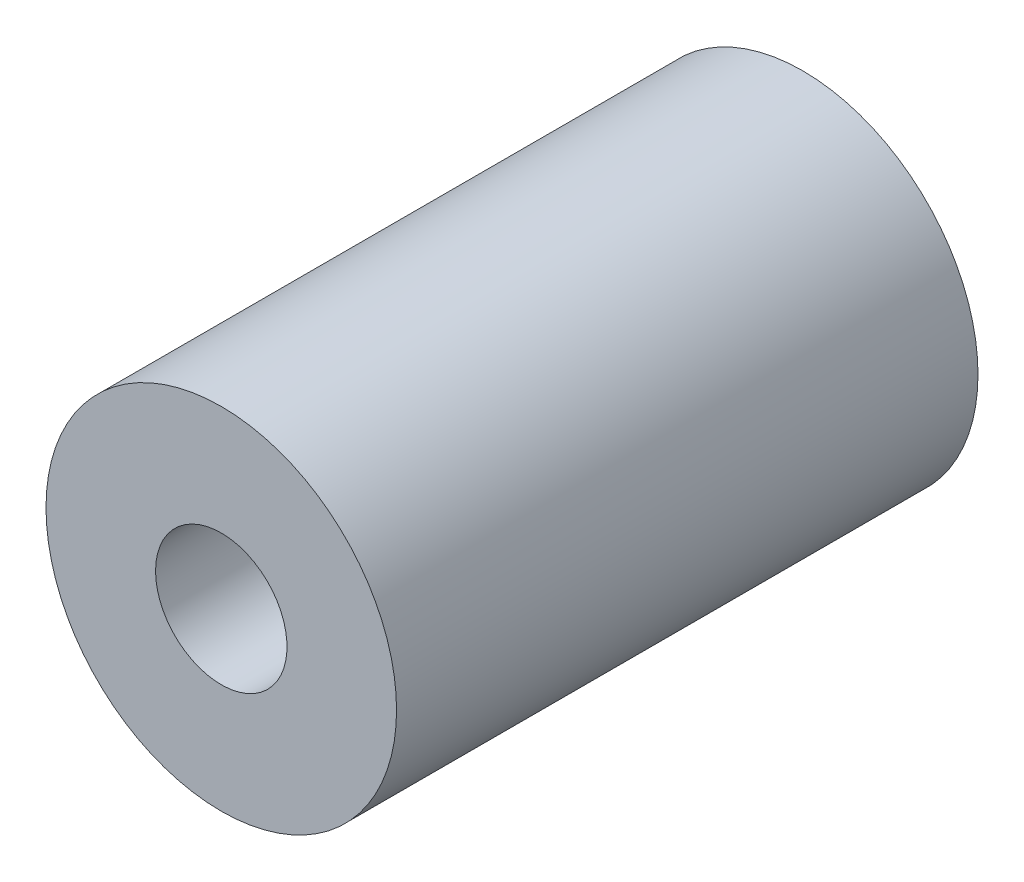
ISO-10303-21;
HEADER;
FILE_DESCRIPTION(('STEP AP214'),'2;1');
FILE_NAME('part.step','',(''),(''),'','','');
FILE_SCHEMA(('AUTOMOTIVE_DESIGN { 1 0 10303 214 1 1 1 1 }'));
ENDSEC;
DATA;
#1=APPLICATION_CONTEXT('core data for automotive mechanical design processes');
#2=APPLICATION_PROTOCOL_DEFINITION('international standard','automotive_design',2000,#1);
#3=PRODUCT_CONTEXT('',#1,'mechanical');
#4=PRODUCT('Part','Part','',(#3));
#5=PRODUCT_RELATED_PRODUCT_CATEGORY('part','',(#4));
#6=PRODUCT_DEFINITION_FORMATION('','',#4);
#7=PRODUCT_DEFINITION_CONTEXT('part definition',#1,'design');
#8=PRODUCT_DEFINITION('design','',#6,#7);
#9=PRODUCT_DEFINITION_SHAPE('','',#8);
#10=(LENGTH_UNIT() NAMED_UNIT(*) SI_UNIT(.MILLI.,.METRE.));
#11=(NAMED_UNIT(*) PLANE_ANGLE_UNIT() SI_UNIT($,.RADIAN.));
#12=(NAMED_UNIT(*) SI_UNIT($,.STERADIAN.) SOLID_ANGLE_UNIT());
#13=UNCERTAINTY_MEASURE_WITH_UNIT(LENGTH_MEASURE(1.E-05),#10,'distance_accuracy_value','');
#14=(GEOMETRIC_REPRESENTATION_CONTEXT(3) GLOBAL_UNCERTAINTY_ASSIGNED_CONTEXT((#13)) GLOBAL_UNIT_ASSIGNED_CONTEXT((#10,
#11,#12)) REPRESENTATION_CONTEXT('',''));
#15=CARTESIAN_POINT('',(0.,0.,0.));
#16=DIRECTION('',(0.,0.,1.));
#17=DIRECTION('',(1.,0.,0.));
#18=AXIS2_PLACEMENT_3D('',#15,#16,#17);
#19=CARTESIAN_POINT('',(0.,0.,13.4852813742386));
#20=DIRECTION('',(0.,0.,-1.));
#21=DIRECTION('',(-1.,0.,0.));
#22=AXIS2_PLACEMENT_3D('',#19,#20,#21);
#23=CYLINDRICAL_SURFACE('',#22,3.);
#24=CARTESIAN_POINT('',(0.,0.,5.));
#25=DIRECTION('',(0.,0.,-1.));
#26=DIRECTION('',(-1.,0.,0.));
#27=AXIS2_PLACEMENT_3D('',#24,#25,#26);
#28=CIRCLE('',#27,3.);
#29=CARTESIAN_POINT('',(-3.,0.,5.));
#30=VERTEX_POINT('',#29);
#31=EDGE_CURVE('E42',#30,#30,#28,.T.);
#32=ORIENTED_EDGE('',*,*,#31,.T.);
#33=EDGE_LOOP('',(#32));
#34=FACE_BOUND('',#33,.T.);
#35=CARTESIAN_POINT('',(0.,0.,-4.95175369474055));
#36=DIRECTION('',(0.,0.,1.));
#37=DIRECTION('',(1.,0.,0.));
#38=AXIS2_PLACEMENT_3D('',#35,#36,#37);
#39=CIRCLE('',#38,3.);
#40=CARTESIAN_POINT('',(3.,0.,-4.95175369474055));
#41=VERTEX_POINT('',#40);
#42=EDGE_CURVE('E46',#41,#41,#39,.F.);
#43=ORIENTED_EDGE('',*,*,#42,.F.);
#44=EDGE_LOOP('',(#43));
#45=FACE_BOUND('',#44,.T.);
#46=ADVANCED_FACE('F35',(#34,#45),#23,.T.);
#47=CARTESIAN_POINT('',(0.,0.,13.4852813742386));
#48=DIRECTION('',(0.,0.,-1.));
#49=DIRECTION('',(-1.,0.,0.));
#50=AXIS2_PLACEMENT_3D('',#47,#48,#49);
#51=CYLINDRICAL_SURFACE('',#50,1.125);
#52=CARTESIAN_POINT('',(0.,0.,5.));
#53=DIRECTION('',(0.,0.,-1.));
#54=DIRECTION('',(-1.,0.,0.));
#55=AXIS2_PLACEMENT_3D('',#52,#53,#54);
#56=CIRCLE('',#55,1.125);
#57=CARTESIAN_POINT('',(-1.125,0.,5.));
#58=VERTEX_POINT('',#57);
#59=EDGE_CURVE('E10',#58,#58,#56,.T.);
#60=ORIENTED_EDGE('',*,*,#59,.F.);
#61=EDGE_LOOP('',(#60));
#62=FACE_BOUND('',#61,.T.);
#63=CARTESIAN_POINT('',(0.,0.,-4.95175369474055));
#64=DIRECTION('',(0.,0.,1.));
#65=DIRECTION('',(1.,0.,0.));
#66=AXIS2_PLACEMENT_3D('',#63,#64,#65);
#67=CIRCLE('',#66,1.125);
#68=CARTESIAN_POINT('',(1.125,0.,-4.95175369474055));
#69=VERTEX_POINT('',#68);
#70=EDGE_CURVE('E50',#69,#69,#67,.F.);
#71=ORIENTED_EDGE('',*,*,#70,.T.);
#72=EDGE_LOOP('',(#71));
#73=FACE_BOUND('',#72,.T.);
#74=ADVANCED_FACE('F56',(#62,#73),#51,.F.);
#75=CARTESIAN_POINT('',(-49.9091830979577,52.4206434081149,5.));
#76=DIRECTION('',(0.,0.,-1.));
#77=DIRECTION('',(-0.620073861649409,0.784543437993837,0.));
#78=AXIS2_PLACEMENT_3D('',#75,#76,#77);
#79=PLANE('',#78);
#80=ORIENTED_EDGE('',*,*,#59,.T.);
#81=EDGE_LOOP('',(#80));
#82=FACE_BOUND('',#81,.T.);
#83=ORIENTED_EDGE('',*,*,#31,.F.);
#84=EDGE_LOOP('',(#83));
#85=FACE_BOUND('',#84,.T.);
#86=ADVANCED_FACE('F37',(#82,#85),#79,.F.);
#87=CARTESIAN_POINT('',(50.5090283814231,4.23090439086009,-4.95175369474055));
#88=DIRECTION('',(0.,0.,1.));
#89=DIRECTION('',(0.620073861649409,-0.784543437993837,0.));
#90=AXIS2_PLACEMENT_3D('',#87,#88,#89);
#91=PLANE('',#90);
#92=ORIENTED_EDGE('',*,*,#42,.T.);
#93=EDGE_LOOP('',(#92));
#94=FACE_BOUND('',#93,.T.);
#95=ORIENTED_EDGE('',*,*,#70,.F.);
#96=EDGE_LOOP('',(#95));
#97=FACE_BOUND('',#96,.T.);
#98=ADVANCED_FACE('F58',(#94,#97),#91,.F.);
#99=CLOSED_SHELL('',(#46,#74,#86,#98));
#100=MANIFOLD_SOLID_BREP('B2',#99);
#101=ADVANCED_BREP_SHAPE_REPRESENTATION('',(#18,#100),#14);
#102=SHAPE_DEFINITION_REPRESENTATION(#9,#101);
ENDSEC;
END-ISO-10303-21;
